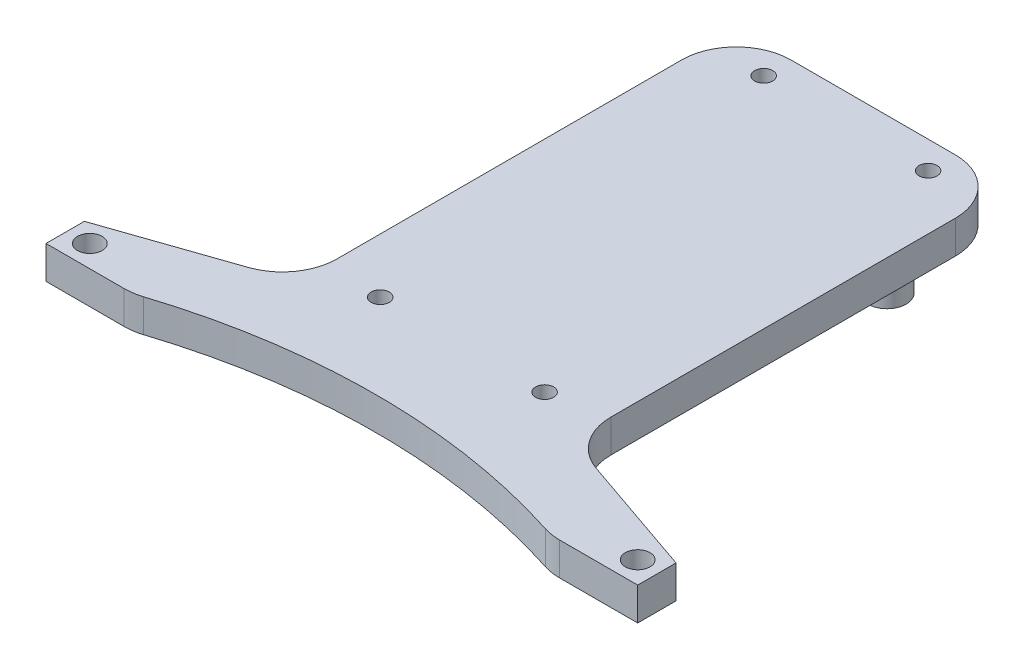
ISO-10303-21;
HEADER;
FILE_DESCRIPTION(('STEP AP214'),'2;1');
FILE_NAME('part.step','',(''),(''),'','','');
FILE_SCHEMA(('AUTOMOTIVE_DESIGN { 1 0 10303 214 1 1 1 1 }'));
ENDSEC;
DATA;
#1=APPLICATION_CONTEXT('core data for automotive mechanical design processes');
#2=APPLICATION_PROTOCOL_DEFINITION('international standard','automotive_design',2000,#1);
#3=PRODUCT_CONTEXT('',#1,'mechanical');
#4=PRODUCT('Part','Part','',(#3));
#5=PRODUCT_RELATED_PRODUCT_CATEGORY('part','',(#4));
#6=PRODUCT_DEFINITION_FORMATION('','',#4);
#7=PRODUCT_DEFINITION_CONTEXT('part definition',#1,'design');
#8=PRODUCT_DEFINITION('design','',#6,#7);
#9=PRODUCT_DEFINITION_SHAPE('','',#8);
#10=(LENGTH_UNIT() NAMED_UNIT(*) SI_UNIT(.MILLI.,.METRE.));
#11=(NAMED_UNIT(*) PLANE_ANGLE_UNIT() SI_UNIT($,.RADIAN.));
#12=(NAMED_UNIT(*) SI_UNIT($,.STERADIAN.) SOLID_ANGLE_UNIT());
#13=UNCERTAINTY_MEASURE_WITH_UNIT(LENGTH_MEASURE(1.E-05),#10,'distance_accuracy_value','');
#14=(GEOMETRIC_REPRESENTATION_CONTEXT(3) GLOBAL_UNCERTAINTY_ASSIGNED_CONTEXT((#13)) GLOBAL_UNIT_ASSIGNED_CONTEXT((#10,
#11,#12)) REPRESENTATION_CONTEXT('',''));
#15=CARTESIAN_POINT('',(0.,0.,0.));
#16=DIRECTION('',(0.,0.,1.));
#17=DIRECTION('',(1.,0.,0.));
#18=AXIS2_PLACEMENT_3D('',#15,#16,#17);
#19=CARTESIAN_POINT('',(0.,6.,0.));
#20=DIRECTION('',(0.,-1.,0.));
#21=DIRECTION('',(0.,0.,-1.));
#22=AXIS2_PLACEMENT_3D('',#19,#20,#21);
#23=PLANE('',#22);
#24=CARTESIAN_POINT('',(54.,6.,114.78240283249));
#25=DIRECTION('',(0.,1.,0.));
#26=DIRECTION('',(0.,0.,1.));
#27=AXIS2_PLACEMENT_3D('',#24,#25,#26);
#28=CIRCLE('',#27,120.);
#29=CARTESIAN_POINT('',(90.6673848479396,6.,0.521723294806958));
#30=VERTEX_POINT('',#29);
#31=CARTESIAN_POINT('',(17.3326151520604,6.,0.521723294806958));
#32=VERTEX_POINT('',#31);
#33=EDGE_CURVE('E212',#30,#32,#28,.T.);
#34=ORIENTED_EDGE('',*,*,#33,.F.);
#35=CARTESIAN_POINT('',(93.7230002519345,6.,-8.99999999999997));
#36=DIRECTION('',(0.,-1.,0.));
#37=DIRECTION('',(0.,0.,-1.));
#38=AXIS2_PLACEMENT_3D('',#35,#36,#37);
#39=CIRCLE('',#38,10.);
#40=CARTESIAN_POINT('',(93.7230002519345,6.,1.));
#41=VERTEX_POINT('',#40);
#42=EDGE_CURVE('E345',#30,#41,#39,.F.);
#43=ORIENTED_EDGE('',*,*,#42,.T.);
#44=DIRECTION('',(1.,0.,0.));
#45=VECTOR('',#44,1.);
#46=CARTESIAN_POINT('',(108.,6.,1.));
#47=LINE('',#46,#45);
#48=CARTESIAN_POINT('',(108.,6.,1.));
#49=VERTEX_POINT('',#48);
#50=EDGE_CURVE('E168',#41,#49,#47,.T.);
#51=ORIENTED_EDGE('',*,*,#50,.T.);
#52=DIRECTION('',(0.,0.,-1.));
#53=VECTOR('',#52,1.);
#54=CARTESIAN_POINT('',(108.,6.,0.));
#55=LINE('',#54,#53);
#56=CARTESIAN_POINT('',(108.,6.,-6.));
#57=VERTEX_POINT('',#56);
#58=EDGE_CURVE('E182',#49,#57,#55,.T.);
#59=ORIENTED_EDGE('',*,*,#58,.T.);
#60=DIRECTION('',(-0.945372981626272,0.,-0.325990683319405));
#61=VECTOR('',#60,1.);
#62=CARTESIAN_POINT('',(79.,6.,-16.));
#63=LINE('',#62,#61);
#64=CARTESIAN_POINT('',(85.7400931668059,6.,-13.6758299424807));
#65=VERTEX_POINT('',#64);
#66=EDGE_CURVE('E267',#57,#65,#63,.T.);
#67=ORIENTED_EDGE('',*,*,#66,.T.);
#68=CARTESIAN_POINT('',(89.,6.,-23.1295597587434));
#69=DIRECTION('',(0.,-1.,0.));
#70=DIRECTION('',(0.,0.,-1.));
#71=AXIS2_PLACEMENT_3D('',#68,#69,#70);
#72=CIRCLE('',#71,10.);
#73=CARTESIAN_POINT('',(79.,6.,-23.1295597587434));
#74=VERTEX_POINT('',#73);
#75=EDGE_CURVE('E395',#65,#74,#72,.T.);
#76=ORIENTED_EDGE('',*,*,#75,.T.);
#77=DIRECTION('',(0.,0.,-1.));
#78=VECTOR('',#77,1.);
#79=CARTESIAN_POINT('',(79.,6.,-96.));
#80=LINE('',#79,#78);
#81=CARTESIAN_POINT('',(79.,6.,-86.));
#82=VERTEX_POINT('',#81);
#83=EDGE_CURVE('E271',#74,#82,#80,.T.);
#84=ORIENTED_EDGE('',*,*,#83,.T.);
#85=CARTESIAN_POINT('',(69.,6.,-86.));
#86=DIRECTION('',(0.,-1.,0.));
#87=DIRECTION('',(0.,0.,-1.));
#88=AXIS2_PLACEMENT_3D('',#85,#86,#87);
#89=CIRCLE('',#88,10.);
#90=CARTESIAN_POINT('',(69.,6.,-96.));
#91=VERTEX_POINT('',#90);
#92=EDGE_CURVE('E339',#82,#91,#89,.F.);
#93=ORIENTED_EDGE('',*,*,#92,.T.);
#94=DIRECTION('',(-1.,0.,0.));
#95=VECTOR('',#94,1.);
#96=CARTESIAN_POINT('',(29.,6.,-96.));
#97=LINE('',#96,#95);
#98=CARTESIAN_POINT('',(39.,6.,-96.));
#99=VERTEX_POINT('',#98);
#100=EDGE_CURVE('E275',#91,#99,#97,.T.);
#101=ORIENTED_EDGE('',*,*,#100,.T.);
#102=CARTESIAN_POINT('',(39.,6.,-86.));
#103=DIRECTION('',(0.,-1.,0.));
#104=DIRECTION('',(0.,0.,-1.));
#105=AXIS2_PLACEMENT_3D('',#102,#103,#104);
#106=CIRCLE('',#105,10.);
#107=CARTESIAN_POINT('',(29.,6.,-86.));
#108=VERTEX_POINT('',#107);
#109=EDGE_CURVE('E336',#99,#108,#106,.F.);
#110=ORIENTED_EDGE('',*,*,#109,.T.);
#111=DIRECTION('',(0.,0.,1.));
#112=VECTOR('',#111,1.);
#113=CARTESIAN_POINT('',(29.,6.,-16.));
#114=LINE('',#113,#112);
#115=CARTESIAN_POINT('',(29.,6.,-23.1295597587434));
#116=VERTEX_POINT('',#115);
#117=EDGE_CURVE('E279',#108,#116,#114,.T.);
#118=ORIENTED_EDGE('',*,*,#117,.T.);
#119=CARTESIAN_POINT('',(19.,6.,-23.1295597587434));
#120=DIRECTION('',(0.,-1.,0.));
#121=DIRECTION('',(0.,0.,-1.));
#122=AXIS2_PLACEMENT_3D('',#119,#120,#121);
#123=CIRCLE('',#122,10.);
#124=CARTESIAN_POINT('',(22.259906833194,6.,-13.6758299424807));
#125=VERTEX_POINT('',#124);
#126=EDGE_CURVE('E11',#116,#125,#123,.T.);
#127=ORIENTED_EDGE('',*,*,#126,.T.);
#128=DIRECTION('',(-0.945372981626272,0.,0.325990683319404));
#129=VECTOR('',#128,1.);
#130=CARTESIAN_POINT('',(0.,6.,-6.));
#131=LINE('',#130,#129);
#132=CARTESIAN_POINT('',(0.,6.,-6.));
#133=VERTEX_POINT('',#132);
#134=EDGE_CURVE('E283',#125,#133,#131,.T.);
#135=ORIENTED_EDGE('',*,*,#134,.T.);
#136=DIRECTION('',(0.,0.,1.));
#137=VECTOR('',#136,1.);
#138=CARTESIAN_POINT('',(0.,6.,0.));
#139=LINE('',#138,#137);
#140=CARTESIAN_POINT('',(0.,6.,1.));
#141=VERTEX_POINT('',#140);
#142=EDGE_CURVE('E261',#133,#141,#139,.T.);
#143=ORIENTED_EDGE('',*,*,#142,.T.);
#144=DIRECTION('',(1.,0.,0.));
#145=VECTOR('',#144,1.);
#146=CARTESIAN_POINT('',(0.,6.,1.));
#147=LINE('',#146,#145);
#148=CARTESIAN_POINT('',(14.2769997480654,6.,1.));
#149=VERTEX_POINT('',#148);
#150=EDGE_CURVE('E188',#141,#149,#147,.T.);
#151=ORIENTED_EDGE('',*,*,#150,.T.);
#152=CARTESIAN_POINT('',(14.2769997480654,6.,-8.99999999999997));
#153=DIRECTION('',(0.,-1.,0.));
#154=DIRECTION('',(0.,0.,-1.));
#155=AXIS2_PLACEMENT_3D('',#152,#153,#154);
#156=CIRCLE('',#155,10.);
#157=EDGE_CURVE('E342',#149,#32,#156,.F.);
#158=ORIENTED_EDGE('',*,*,#157,.T.);
#159=EDGE_LOOP('',(#34,#43,#51,#59,#67,#76,#84,#93,#101,#110,#118,#127,#135,#143,#151,#158));
#160=FACE_BOUND('',#159,.T.);
#161=CARTESIAN_POINT('',(4.,6.,-3.));
#162=DIRECTION('',(0.,1.,0.));
#163=DIRECTION('',(0.,0.,1.));
#164=AXIS2_PLACEMENT_3D('',#161,#162,#163);
#165=CIRCLE('',#164,2.25);
#166=CARTESIAN_POINT('',(4.,6.,-0.749999999999999));
#167=VERTEX_POINT('',#166);
#168=EDGE_CURVE('E254',#167,#167,#165,.T.);
#169=ORIENTED_EDGE('',*,*,#168,.F.);
#170=EDGE_LOOP('',(#169));
#171=FACE_BOUND('',#170,.T.);
#172=CARTESIAN_POINT('',(104.,6.,-3.));
#173=DIRECTION('',(0.,1.,0.));
#174=DIRECTION('',(0.,0.,1.));
#175=AXIS2_PLACEMENT_3D('',#172,#173,#174);
#176=CIRCLE('',#175,2.25);
#177=CARTESIAN_POINT('',(104.,6.,-0.750000000000004));
#178=VERTEX_POINT('',#177);
#179=EDGE_CURVE('E246',#178,#178,#176,.T.);
#180=ORIENTED_EDGE('',*,*,#179,.F.);
#181=EDGE_LOOP('',(#180));
#182=FACE_BOUND('',#181,.T.);
#183=CARTESIAN_POINT('',(39.,6.,-91.));
#184=DIRECTION('',(0.,1.,0.));
#185=DIRECTION('',(0.,0.,1.));
#186=AXIS2_PLACEMENT_3D('',#183,#184,#185);
#187=CIRCLE('',#186,1.65);
#188=CARTESIAN_POINT('',(39.,6.,-89.35));
#189=VERTEX_POINT('',#188);
#190=EDGE_CURVE('E238',#189,#189,#187,.T.);
#191=ORIENTED_EDGE('',*,*,#190,.F.);
#192=EDGE_LOOP('',(#191));
#193=FACE_BOUND('',#192,.T.);
#194=CARTESIAN_POINT('',(69.,6.,-91.));
#195=DIRECTION('',(0.,1.,0.));
#196=DIRECTION('',(0.,0.,1.));
#197=AXIS2_PLACEMENT_3D('',#194,#195,#196);
#198=CIRCLE('',#197,1.65);
#199=CARTESIAN_POINT('',(69.,6.,-89.35));
#200=VERTEX_POINT('',#199);
#201=EDGE_CURVE('E230',#200,#200,#198,.T.);
#202=ORIENTED_EDGE('',*,*,#201,.F.);
#203=EDGE_LOOP('',(#202));
#204=FACE_BOUND('',#203,.T.);
#205=CARTESIAN_POINT('',(39.,6.,-21.));
#206=DIRECTION('',(0.,1.,0.));
#207=DIRECTION('',(0.,0.,1.));
#208=AXIS2_PLACEMENT_3D('',#205,#206,#207);
#209=CIRCLE('',#208,1.65);
#210=CARTESIAN_POINT('',(39.,6.,-19.35));
#211=VERTEX_POINT('',#210);
#212=EDGE_CURVE('E222',#211,#211,#209,.T.);
#213=ORIENTED_EDGE('',*,*,#212,.F.);
#214=EDGE_LOOP('',(#213));
#215=FACE_BOUND('',#214,.T.);
#216=CARTESIAN_POINT('',(68.9999999999999,6.,-21.));
#217=DIRECTION('',(0.,1.,0.));
#218=DIRECTION('',(0.,0.,1.));
#219=AXIS2_PLACEMENT_3D('',#216,#217,#218);
#220=CIRCLE('',#219,1.65);
#221=CARTESIAN_POINT('',(68.9999999999999,6.,-19.35));
#222=VERTEX_POINT('',#221);
#223=EDGE_CURVE('E213',#222,#222,#220,.T.);
#224=ORIENTED_EDGE('',*,*,#223,.F.);
#225=EDGE_LOOP('',(#224));
#226=FACE_BOUND('',#225,.T.);
#227=ADVANCED_FACE('F45',(#160,#171,#182,#193,#204,#215,#226),#23,.F.);
#228=CARTESIAN_POINT('',(0.,0.,0.));
#229=DIRECTION('',(0.,-1.,0.));
#230=DIRECTION('',(0.,0.,-1.));
#231=AXIS2_PLACEMENT_3D('',#228,#229,#230);
#232=PLANE('',#231);
#233=CARTESIAN_POINT('',(71.5,0.,-81.));
#234=DIRECTION('',(0.,-1.,0.));
#235=DIRECTION('',(0.,0.,-1.));
#236=AXIS2_PLACEMENT_3D('',#233,#234,#235);
#237=CIRCLE('',#236,5.50000000000001);
#238=CARTESIAN_POINT('',(71.5,0.,-86.5));
#239=VERTEX_POINT('',#238);
#240=EDGE_CURVE('E321',#239,#239,#237,.F.);
#241=ORIENTED_EDGE('',*,*,#240,.T.);
#242=EDGE_LOOP('',(#241));
#243=FACE_BOUND('',#242,.T.);
#244=CARTESIAN_POINT('',(36.5,0.,-81.));
#245=DIRECTION('',(0.,-1.,0.));
#246=DIRECTION('',(0.,0.,-1.));
#247=AXIS2_PLACEMENT_3D('',#244,#245,#246);
#248=CIRCLE('',#247,5.50000000000001);
#249=CARTESIAN_POINT('',(36.5,0.,-86.5));
#250=VERTEX_POINT('',#249);
#251=EDGE_CURVE('E317',#250,#250,#248,.F.);
#252=ORIENTED_EDGE('',*,*,#251,.T.);
#253=EDGE_LOOP('',(#252));
#254=FACE_BOUND('',#253,.T.);
#255=DIRECTION('',(1.,0.,0.));
#256=VECTOR('',#255,1.);
#257=CARTESIAN_POINT('',(108.,0.,1.));
#258=LINE('',#257,#256);
#259=CARTESIAN_POINT('',(93.7230002519345,0.,1.));
#260=VERTEX_POINT('',#259);
#261=CARTESIAN_POINT('',(108.,0.,1.));
#262=VERTEX_POINT('',#261);
#263=EDGE_CURVE('E158',#260,#262,#258,.T.);
#264=ORIENTED_EDGE('',*,*,#263,.F.);
#265=CARTESIAN_POINT('',(93.7230002519345,0.,-8.99999999999997));
#266=DIRECTION('',(0.,-1.,0.));
#267=DIRECTION('',(0.,0.,-1.));
#268=AXIS2_PLACEMENT_3D('',#265,#266,#267);
#269=CIRCLE('',#268,10.);
#270=CARTESIAN_POINT('',(90.6673848479396,0.,0.521723294806958));
#271=VERTEX_POINT('',#270);
#272=EDGE_CURVE('E358',#260,#271,#269,.T.);
#273=ORIENTED_EDGE('',*,*,#272,.T.);
#274=CARTESIAN_POINT('',(54.,0.,114.78240283249));
#275=DIRECTION('',(0.,1.,0.));
#276=DIRECTION('',(0.,0.,-1.));
#277=AXIS2_PLACEMENT_3D('',#274,#275,#276);
#278=CIRCLE('',#277,120.);
#279=CARTESIAN_POINT('',(17.3326151520604,0.,0.521723294806958));
#280=VERTEX_POINT('',#279);
#281=EDGE_CURVE('E208',#271,#280,#278,.T.);
#282=ORIENTED_EDGE('',*,*,#281,.T.);
#283=CARTESIAN_POINT('',(14.2769997480654,0.,-8.99999999999997));
#284=DIRECTION('',(0.,-1.,0.));
#285=DIRECTION('',(0.,0.,-1.));
#286=AXIS2_PLACEMENT_3D('',#283,#284,#285);
#287=CIRCLE('',#286,10.);
#288=CARTESIAN_POINT('',(14.2769997480654,0.,1.));
#289=VERTEX_POINT('',#288);
#290=EDGE_CURVE('E355',#280,#289,#287,.T.);
#291=ORIENTED_EDGE('',*,*,#290,.T.);
#292=DIRECTION('',(1.,0.,0.));
#293=VECTOR('',#292,1.);
#294=CARTESIAN_POINT('',(0.,0.,1.));
#295=LINE('',#294,#293);
#296=CARTESIAN_POINT('',(0.,0.,1.));
#297=VERTEX_POINT('',#296);
#298=EDGE_CURVE('E193',#297,#289,#295,.T.);
#299=ORIENTED_EDGE('',*,*,#298,.F.);
#300=DIRECTION('',(0.,0.,1.));
#301=VECTOR('',#300,1.);
#302=CARTESIAN_POINT('',(0.,0.,0.));
#303=LINE('',#302,#301);
#304=CARTESIAN_POINT('',(0.,0.,-6.));
#305=VERTEX_POINT('',#304);
#306=EDGE_CURVE('E178',#305,#297,#303,.T.);
#307=ORIENTED_EDGE('',*,*,#306,.F.);
#308=DIRECTION('',(-0.945372981626272,0.,0.325990683319404));
#309=VECTOR('',#308,1.);
#310=CARTESIAN_POINT('',(0.,0.,-6.));
#311=LINE('',#310,#309);
#312=CARTESIAN_POINT('',(22.259906833194,0.,-13.6758299424807));
#313=VERTEX_POINT('',#312);
#314=EDGE_CURVE('E264',#313,#305,#311,.T.);
#315=ORIENTED_EDGE('',*,*,#314,.F.);
#316=CARTESIAN_POINT('',(19.,0.,-23.1295597587434));
#317=DIRECTION('',(0.,-1.,0.));
#318=DIRECTION('',(0.,0.,-1.));
#319=AXIS2_PLACEMENT_3D('',#316,#317,#318);
#320=CIRCLE('',#319,10.);
#321=CARTESIAN_POINT('',(29.,0.,-23.1295597587434));
#322=VERTEX_POINT('',#321);
#323=EDGE_CURVE('E54',#313,#322,#320,.F.);
#324=ORIENTED_EDGE('',*,*,#323,.T.);
#325=DIRECTION('',(0.,0.,1.));
#326=VECTOR('',#325,1.);
#327=CARTESIAN_POINT('',(29.,0.,-16.));
#328=LINE('',#327,#326);
#329=CARTESIAN_POINT('',(29.,0.,-86.));
#330=VERTEX_POINT('',#329);
#331=EDGE_CURVE('E298',#330,#322,#328,.T.);
#332=ORIENTED_EDGE('',*,*,#331,.F.);
#333=CARTESIAN_POINT('',(39.,0.,-86.));
#334=DIRECTION('',(0.,-1.,0.));
#335=DIRECTION('',(0.,0.,-1.));
#336=AXIS2_PLACEMENT_3D('',#333,#334,#335);
#337=CIRCLE('',#336,10.);
#338=CARTESIAN_POINT('',(39.,0.,-96.));
#339=VERTEX_POINT('',#338);
#340=EDGE_CURVE('E350',#330,#339,#337,.T.);
#341=ORIENTED_EDGE('',*,*,#340,.T.);
#342=DIRECTION('',(-1.,0.,0.));
#343=VECTOR('',#342,1.);
#344=CARTESIAN_POINT('',(29.,0.,-96.));
#345=LINE('',#344,#343);
#346=CARTESIAN_POINT('',(69.,0.,-96.));
#347=VERTEX_POINT('',#346);
#348=EDGE_CURVE('E294',#347,#339,#345,.T.);
#349=ORIENTED_EDGE('',*,*,#348,.F.);
#350=CARTESIAN_POINT('',(69.,0.,-86.));
#351=DIRECTION('',(0.,-1.,0.));
#352=DIRECTION('',(0.,0.,-1.));
#353=AXIS2_PLACEMENT_3D('',#350,#351,#352);
#354=CIRCLE('',#353,10.);
#355=CARTESIAN_POINT('',(79.,0.,-86.));
#356=VERTEX_POINT('',#355);
#357=EDGE_CURVE('E67',#347,#356,#354,.T.);
#358=ORIENTED_EDGE('',*,*,#357,.T.);
#359=DIRECTION('',(0.,0.,-1.));
#360=VECTOR('',#359,1.);
#361=CARTESIAN_POINT('',(79.,0.,-96.));
#362=LINE('',#361,#360);
#363=CARTESIAN_POINT('',(79.,0.,-23.1295597587434));
#364=VERTEX_POINT('',#363);
#365=EDGE_CURVE('E291',#364,#356,#362,.T.);
#366=ORIENTED_EDGE('',*,*,#365,.F.);
#367=CARTESIAN_POINT('',(89.,0.,-23.1295597587434));
#368=DIRECTION('',(0.,-1.,0.));
#369=DIRECTION('',(0.,0.,-1.));
#370=AXIS2_PLACEMENT_3D('',#367,#368,#369);
#371=CIRCLE('',#370,10.);
#372=CARTESIAN_POINT('',(85.7400931668059,0.,-13.6758299424807));
#373=VERTEX_POINT('',#372);
#374=EDGE_CURVE('E61',#364,#373,#371,.F.);
#375=ORIENTED_EDGE('',*,*,#374,.T.);
#376=DIRECTION('',(-0.945372981626272,0.,-0.325990683319405));
#377=VECTOR('',#376,1.);
#378=CARTESIAN_POINT('',(79.,0.,-16.));
#379=LINE('',#378,#377);
#380=CARTESIAN_POINT('',(108.,0.,-6.));
#381=VERTEX_POINT('',#380);
#382=EDGE_CURVE('E173',#381,#373,#379,.T.);
#383=ORIENTED_EDGE('',*,*,#382,.F.);
#384=DIRECTION('',(0.,0.,-1.));
#385=VECTOR('',#384,1.);
#386=CARTESIAN_POINT('',(108.,0.,0.));
#387=LINE('',#386,#385);
#388=EDGE_CURVE('E170',#262,#381,#387,.T.);
#389=ORIENTED_EDGE('',*,*,#388,.F.);
#390=EDGE_LOOP('',(#264,#273,#282,#291,#299,#307,#315,#324,#332,#341,#349,#358,#366,#375,#383,#389));
#391=FACE_BOUND('',#390,.T.);
#392=CARTESIAN_POINT('',(39.,0.,-21.));
#393=DIRECTION('',(0.,1.,0.));
#394=DIRECTION('',(0.,0.,1.));
#395=AXIS2_PLACEMENT_3D('',#392,#393,#394);
#396=CIRCLE('',#395,1.65);
#397=CARTESIAN_POINT('',(39.,0.,-19.35));
#398=VERTEX_POINT('',#397);
#399=EDGE_CURVE('E217',#398,#398,#396,.T.);
#400=ORIENTED_EDGE('',*,*,#399,.T.);
#401=EDGE_LOOP('',(#400));
#402=FACE_BOUND('',#401,.T.);
#403=CARTESIAN_POINT('',(39.,0.,-91.));
#404=DIRECTION('',(0.,1.,0.));
#405=DIRECTION('',(0.,0.,1.));
#406=AXIS2_PLACEMENT_3D('',#403,#404,#405);
#407=CIRCLE('',#406,1.65);
#408=CARTESIAN_POINT('',(39.,0.,-89.35));
#409=VERTEX_POINT('',#408);
#410=EDGE_CURVE('E234',#409,#409,#407,.T.);
#411=ORIENTED_EDGE('',*,*,#410,.T.);
#412=EDGE_LOOP('',(#411));
#413=FACE_BOUND('',#412,.T.);
#414=CARTESIAN_POINT('',(4.,0.,-3.));
#415=DIRECTION('',(0.,1.,0.));
#416=DIRECTION('',(0.,0.,1.));
#417=AXIS2_PLACEMENT_3D('',#414,#415,#416);
#418=CIRCLE('',#417,2.25);
#419=CARTESIAN_POINT('',(4.,0.,-0.749999999999999));
#420=VERTEX_POINT('',#419);
#421=EDGE_CURVE('E250',#420,#420,#418,.T.);
#422=ORIENTED_EDGE('',*,*,#421,.T.);
#423=EDGE_LOOP('',(#422));
#424=FACE_BOUND('',#423,.T.);
#425=CARTESIAN_POINT('',(104.,0.,-3.));
#426=DIRECTION('',(0.,1.,0.));
#427=DIRECTION('',(0.,0.,1.));
#428=AXIS2_PLACEMENT_3D('',#425,#426,#427);
#429=CIRCLE('',#428,2.25);
#430=CARTESIAN_POINT('',(104.,0.,-0.750000000000004));
#431=VERTEX_POINT('',#430);
#432=EDGE_CURVE('E242',#431,#431,#429,.T.);
#433=ORIENTED_EDGE('',*,*,#432,.T.);
#434=EDGE_LOOP('',(#433));
#435=FACE_BOUND('',#434,.T.);
#436=CARTESIAN_POINT('',(69.,0.,-91.));
#437=DIRECTION('',(0.,1.,0.));
#438=DIRECTION('',(0.,0.,1.));
#439=AXIS2_PLACEMENT_3D('',#436,#437,#438);
#440=CIRCLE('',#439,1.65);
#441=CARTESIAN_POINT('',(69.,0.,-89.35));
#442=VERTEX_POINT('',#441);
#443=EDGE_CURVE('E226',#442,#442,#440,.T.);
#444=ORIENTED_EDGE('',*,*,#443,.T.);
#445=EDGE_LOOP('',(#444));
#446=FACE_BOUND('',#445,.T.);
#447=CARTESIAN_POINT('',(68.9999999999999,0.,-21.));
#448=DIRECTION('',(0.,1.,0.));
#449=DIRECTION('',(0.,0.,1.));
#450=AXIS2_PLACEMENT_3D('',#447,#448,#449);
#451=CIRCLE('',#450,1.65);
#452=CARTESIAN_POINT('',(68.9999999999999,0.,-19.35));
#453=VERTEX_POINT('',#452);
#454=EDGE_CURVE('E218',#453,#453,#451,.T.);
#455=ORIENTED_EDGE('',*,*,#454,.T.);
#456=EDGE_LOOP('',(#455));
#457=FACE_BOUND('',#456,.T.);
#458=ADVANCED_FACE('F171',(#243,#254,#391,#402,#413,#424,#435,#446,#457),#232,.T.);
#459=CARTESIAN_POINT('',(0.,6.,0.));
#460=DIRECTION('',(1.,0.,0.));
#461=DIRECTION('',(0.,0.,-1.));
#462=AXIS2_PLACEMENT_3D('',#459,#460,#461);
#463=PLANE('',#462);
#464=ORIENTED_EDGE('',*,*,#306,.T.);
#465=DIRECTION('',(0.,1.,0.));
#466=VECTOR('',#465,1.);
#467=CARTESIAN_POINT('',(0.,-19.0262975904404,1.));
#468=LINE('',#467,#466);
#469=EDGE_CURVE('E192',#297,#141,#468,.T.);
#470=ORIENTED_EDGE('',*,*,#469,.T.);
#471=ORIENTED_EDGE('',*,*,#142,.F.);
#472=DIRECTION('',(0.,-1.,0.));
#473=VECTOR('',#472,1.);
#474=CARTESIAN_POINT('',(0.,6.,-6.));
#475=LINE('',#474,#473);
#476=EDGE_CURVE('E286',#133,#305,#475,.T.);
#477=ORIENTED_EDGE('',*,*,#476,.T.);
#478=EDGE_LOOP('',(#464,#470,#471,#477));
#479=FACE_BOUND('',#478,.T.);
#480=ADVANCED_FACE('F418',(#479),#463,.F.);
#481=CARTESIAN_POINT('',(108.,6.,0.));
#482=DIRECTION('',(-1.,0.,0.));
#483=DIRECTION('',(0.,0.,1.));
#484=AXIS2_PLACEMENT_3D('',#481,#482,#483);
#485=PLANE('',#484);
#486=ORIENTED_EDGE('',*,*,#388,.T.);
#487=DIRECTION('',(0.,-1.,0.));
#488=VECTOR('',#487,1.);
#489=CARTESIAN_POINT('',(108.,6.,-6.));
#490=LINE('',#489,#488);
#491=EDGE_CURVE('E307',#57,#381,#490,.T.);
#492=ORIENTED_EDGE('',*,*,#491,.F.);
#493=ORIENTED_EDGE('',*,*,#58,.F.);
#494=DIRECTION('',(0.,1.,0.));
#495=VECTOR('',#494,1.);
#496=CARTESIAN_POINT('',(108.,-19.0262975904404,1.));
#497=LINE('',#496,#495);
#498=EDGE_CURVE('E163',#262,#49,#497,.T.);
#499=ORIENTED_EDGE('',*,*,#498,.F.);
#500=EDGE_LOOP('',(#486,#492,#493,#499));
#501=FACE_BOUND('',#500,.T.);
#502=ADVANCED_FACE('F181',(#501),#485,.F.);
#503=CARTESIAN_POINT('',(79.,6.,-16.));
#504=DIRECTION('',(-0.325990683319405,0.,0.945372981626272));
#505=DIRECTION('',(0.945372981626272,0.,0.325990683319405));
#506=AXIS2_PLACEMENT_3D('',#503,#504,#505);
#507=PLANE('',#506);
#508=ORIENTED_EDGE('',*,*,#382,.T.);
#509=DIRECTION('',(0.,-1.,0.));
#510=VECTOR('',#509,1.);
#511=CARTESIAN_POINT('',(85.7400931668059,6.,-13.6758299424807));
#512=LINE('',#511,#510);
#513=EDGE_CURVE('E386',#373,#65,#512,.F.);
#514=ORIENTED_EDGE('',*,*,#513,.T.);
#515=ORIENTED_EDGE('',*,*,#66,.F.);
#516=ORIENTED_EDGE('',*,*,#491,.T.);
#517=EDGE_LOOP('',(#508,#514,#515,#516));
#518=FACE_BOUND('',#517,.T.);
#519=ADVANCED_FACE('F438',(#518),#507,.F.);
#520=CARTESIAN_POINT('',(79.,6.,-96.));
#521=DIRECTION('',(-1.,0.,0.));
#522=DIRECTION('',(0.,0.,1.));
#523=AXIS2_PLACEMENT_3D('',#520,#521,#522);
#524=PLANE('',#523);
#525=ORIENTED_EDGE('',*,*,#365,.T.);
#526=DIRECTION('',(0.,-1.,0.));
#527=VECTOR('',#526,1.);
#528=CARTESIAN_POINT('',(79.,6.,-86.));
#529=LINE('',#528,#527);
#530=EDGE_CURVE('E376',#356,#82,#529,.F.);
#531=ORIENTED_EDGE('',*,*,#530,.T.);
#532=ORIENTED_EDGE('',*,*,#83,.F.);
#533=DIRECTION('',(0.,-1.,0.));
#534=VECTOR('',#533,1.);
#535=CARTESIAN_POINT('',(79.,0.,-23.1295597587434));
#536=LINE('',#535,#534);
#537=EDGE_CURVE('E372',#74,#364,#536,.T.);
#538=ORIENTED_EDGE('',*,*,#537,.T.);
#539=EDGE_LOOP('',(#525,#531,#532,#538));
#540=FACE_BOUND('',#539,.T.);
#541=ADVANCED_FACE('F446',(#540),#524,.F.);
#542=CARTESIAN_POINT('',(29.,6.,-96.));
#543=DIRECTION('',(0.,0.,1.));
#544=DIRECTION('',(1.,0.,0.));
#545=AXIS2_PLACEMENT_3D('',#542,#543,#544);
#546=PLANE('',#545);
#547=ORIENTED_EDGE('',*,*,#100,.F.);
#548=DIRECTION('',(0.,-1.,0.));
#549=VECTOR('',#548,1.);
#550=CARTESIAN_POINT('',(69.,6.,-96.));
#551=LINE('',#550,#549);
#552=EDGE_CURVE('E368',#91,#347,#551,.T.);
#553=ORIENTED_EDGE('',*,*,#552,.T.);
#554=ORIENTED_EDGE('',*,*,#348,.T.);
#555=DIRECTION('',(0.,-1.,0.));
#556=VECTOR('',#555,1.);
#557=CARTESIAN_POINT('',(39.,6.,-96.));
#558=LINE('',#557,#556);
#559=EDGE_CURVE('E365',#339,#99,#558,.F.);
#560=ORIENTED_EDGE('',*,*,#559,.T.);
#561=EDGE_LOOP('',(#547,#553,#554,#560));
#562=FACE_BOUND('',#561,.T.);
#563=ADVANCED_FACE('F454',(#562),#546,.F.);
#564=CARTESIAN_POINT('',(29.,6.,-16.));
#565=DIRECTION('',(1.,0.,0.));
#566=DIRECTION('',(0.,0.,-1.));
#567=AXIS2_PLACEMENT_3D('',#564,#565,#566);
#568=PLANE('',#567);
#569=ORIENTED_EDGE('',*,*,#117,.F.);
#570=DIRECTION('',(0.,-1.,0.));
#571=VECTOR('',#570,1.);
#572=CARTESIAN_POINT('',(29.,6.,-86.));
#573=LINE('',#572,#571);
#574=EDGE_CURVE('E382',#108,#330,#573,.T.);
#575=ORIENTED_EDGE('',*,*,#574,.T.);
#576=ORIENTED_EDGE('',*,*,#331,.T.);
#577=DIRECTION('',(0.,-1.,0.));
#578=VECTOR('',#577,1.);
#579=CARTESIAN_POINT('',(29.,6.,-23.1295597587434));
#580=LINE('',#579,#578);
#581=EDGE_CURVE('E379',#322,#116,#580,.F.);
#582=ORIENTED_EDGE('',*,*,#581,.T.);
#583=EDGE_LOOP('',(#569,#575,#576,#582));
#584=FACE_BOUND('',#583,.T.);
#585=ADVANCED_FACE('F406',(#584),#568,.F.);
#586=CARTESIAN_POINT('',(0.,6.,-6.));
#587=DIRECTION('',(0.325990683319404,0.,0.945372981626272));
#588=DIRECTION('',(0.945372981626272,0.,-0.325990683319404));
#589=AXIS2_PLACEMENT_3D('',#586,#587,#588);
#590=PLANE('',#589);
#591=ORIENTED_EDGE('',*,*,#134,.F.);
#592=DIRECTION('',(0.,-1.,0.));
#593=VECTOR('',#592,1.);
#594=CARTESIAN_POINT('',(22.259906833194,0.,-13.6758299424807));
#595=LINE('',#594,#593);
#596=EDGE_CURVE('E389',#125,#313,#595,.T.);
#597=ORIENTED_EDGE('',*,*,#596,.T.);
#598=ORIENTED_EDGE('',*,*,#314,.T.);
#599=ORIENTED_EDGE('',*,*,#476,.F.);
#600=EDGE_LOOP('',(#591,#597,#598,#599));
#601=FACE_BOUND('',#600,.T.);
#602=ADVANCED_FACE('F415',(#601),#590,.F.);
#603=CARTESIAN_POINT('',(4.,6.,-3.));
#604=DIRECTION('',(0.,-1.,0.));
#605=DIRECTION('',(0.,0.,-1.));
#606=AXIS2_PLACEMENT_3D('',#603,#604,#605);
#607=CYLINDRICAL_SURFACE('',#606,2.25);
#608=ORIENTED_EDGE('',*,*,#168,.T.);
#609=EDGE_LOOP('',(#608));
#610=FACE_BOUND('',#609,.T.);
#611=ORIENTED_EDGE('',*,*,#421,.F.);
#612=EDGE_LOOP('',(#611));
#613=FACE_BOUND('',#612,.T.);
#614=ADVANCED_FACE('F473',(#610,#613),#607,.F.);
#615=CARTESIAN_POINT('',(104.,6.,-3.));
#616=DIRECTION('',(0.,-1.,0.));
#617=DIRECTION('',(0.,0.,-1.));
#618=AXIS2_PLACEMENT_3D('',#615,#616,#617);
#619=CYLINDRICAL_SURFACE('',#618,2.25);
#620=ORIENTED_EDGE('',*,*,#179,.T.);
#621=EDGE_LOOP('',(#620));
#622=FACE_BOUND('',#621,.T.);
#623=ORIENTED_EDGE('',*,*,#432,.F.);
#624=EDGE_LOOP('',(#623));
#625=FACE_BOUND('',#624,.T.);
#626=ADVANCED_FACE('F667',(#622,#625),#619,.F.);
#627=CARTESIAN_POINT('',(39.,6.,-91.));
#628=DIRECTION('',(0.,-1.,0.));
#629=DIRECTION('',(0.,0.,-1.));
#630=AXIS2_PLACEMENT_3D('',#627,#628,#629);
#631=CYLINDRICAL_SURFACE('',#630,1.65);
#632=ORIENTED_EDGE('',*,*,#190,.T.);
#633=EDGE_LOOP('',(#632));
#634=FACE_BOUND('',#633,.T.);
#635=ORIENTED_EDGE('',*,*,#410,.F.);
#636=EDGE_LOOP('',(#635));
#637=FACE_BOUND('',#636,.T.);
#638=ADVANCED_FACE('F657',(#634,#637),#631,.F.);
#639=CARTESIAN_POINT('',(69.,6.,-91.));
#640=DIRECTION('',(0.,-1.,0.));
#641=DIRECTION('',(0.,0.,-1.));
#642=AXIS2_PLACEMENT_3D('',#639,#640,#641);
#643=CYLINDRICAL_SURFACE('',#642,1.65);
#644=ORIENTED_EDGE('',*,*,#201,.T.);
#645=EDGE_LOOP('',(#644));
#646=FACE_BOUND('',#645,.T.);
#647=ORIENTED_EDGE('',*,*,#443,.F.);
#648=EDGE_LOOP('',(#647));
#649=FACE_BOUND('',#648,.T.);
#650=ADVANCED_FACE('F647',(#646,#649),#643,.F.);
#651=CARTESIAN_POINT('',(39.,6.,-21.));
#652=DIRECTION('',(0.,-1.,0.));
#653=DIRECTION('',(0.,0.,-1.));
#654=AXIS2_PLACEMENT_3D('',#651,#652,#653);
#655=CYLINDRICAL_SURFACE('',#654,1.65);
#656=ORIENTED_EDGE('',*,*,#212,.T.);
#657=EDGE_LOOP('',(#656));
#658=FACE_BOUND('',#657,.T.);
#659=ORIENTED_EDGE('',*,*,#399,.F.);
#660=EDGE_LOOP('',(#659));
#661=FACE_BOUND('',#660,.T.);
#662=ADVANCED_FACE('F637',(#658,#661),#655,.F.);
#663=CARTESIAN_POINT('',(68.9999999999999,6.,-21.));
#664=DIRECTION('',(0.,-1.,0.));
#665=DIRECTION('',(0.,0.,-1.));
#666=AXIS2_PLACEMENT_3D('',#663,#664,#665);
#667=CYLINDRICAL_SURFACE('',#666,1.65);
#668=ORIENTED_EDGE('',*,*,#223,.T.);
#669=EDGE_LOOP('',(#668));
#670=FACE_BOUND('',#669,.T.);
#671=ORIENTED_EDGE('',*,*,#454,.F.);
#672=EDGE_LOOP('',(#671));
#673=FACE_BOUND('',#672,.T.);
#674=ADVANCED_FACE('F628',(#670,#673),#667,.F.);
#675=CARTESIAN_POINT('',(54.,0.,114.78240283249));
#676=DIRECTION('',(0.,1.,0.));
#677=DIRECTION('',(0.,0.,1.));
#678=AXIS2_PLACEMENT_3D('',#675,#676,#677);
#679=CYLINDRICAL_SURFACE('',#678,120.);
#680=ORIENTED_EDGE('',*,*,#281,.F.);
#681=DIRECTION('',(0.,1.,0.));
#682=VECTOR('',#681,1.);
#683=CARTESIAN_POINT('',(90.6673848479396,0.,0.521723294806958));
#684=LINE('',#683,#682);
#685=EDGE_CURVE('E332',#271,#30,#684,.T.);
#686=ORIENTED_EDGE('',*,*,#685,.T.);
#687=ORIENTED_EDGE('',*,*,#33,.T.);
#688=DIRECTION('',(0.,1.,0.));
#689=VECTOR('',#688,1.);
#690=CARTESIAN_POINT('',(17.3326151520604,0.,0.521723294806958));
#691=LINE('',#690,#689);
#692=EDGE_CURVE('E329',#32,#280,#691,.F.);
#693=ORIENTED_EDGE('',*,*,#692,.T.);
#694=EDGE_LOOP('',(#680,#686,#687,#693));
#695=FACE_BOUND('',#694,.T.);
#696=ADVANCED_FACE('F431',(#695),#679,.F.);
#697=CARTESIAN_POINT('',(36.5,-7.1,-81.));
#698=DIRECTION('',(0.,1.,0.));
#699=DIRECTION('',(0.,0.,1.));
#700=AXIS2_PLACEMENT_3D('',#697,#698,#699);
#701=CYLINDRICAL_SURFACE('',#700,3.5);
#702=CARTESIAN_POINT('',(36.5,-2.00000000000002,-81.));
#703=DIRECTION('',(0.,-1.,0.));
#704=DIRECTION('',(0.,0.,-1.));
#705=AXIS2_PLACEMENT_3D('',#702,#703,#704);
#706=CIRCLE('',#705,3.5);
#707=CARTESIAN_POINT('',(36.5,-2.00000000000002,-84.5));
#708=VERTEX_POINT('',#707);
#709=EDGE_CURVE('E325',#708,#708,#706,.T.);
#710=ORIENTED_EDGE('',*,*,#709,.T.);
#711=EDGE_LOOP('',(#710));
#712=FACE_BOUND('',#711,.T.);
#713=CARTESIAN_POINT('',(36.5,-7.1,-81.));
#714=DIRECTION('',(0.,-1.,0.));
#715=DIRECTION('',(0.,0.,-1.));
#716=AXIS2_PLACEMENT_3D('',#713,#714,#715);
#717=CIRCLE('',#716,3.5);
#718=CARTESIAN_POINT('',(36.5,-7.1,-84.5));
#719=VERTEX_POINT('',#718);
#720=EDGE_CURVE('E204',#719,#719,#717,.T.);
#721=ORIENTED_EDGE('',*,*,#720,.F.);
#722=EDGE_LOOP('',(#721));
#723=FACE_BOUND('',#722,.T.);
#724=ADVANCED_FACE('F609',(#712,#723),#701,.T.);
#725=CARTESIAN_POINT('',(36.5,-7.1,-81.));
#726=DIRECTION('',(0.,-1.,0.));
#727=DIRECTION('',(0.,0.,-1.));
#728=AXIS2_PLACEMENT_3D('',#725,#726,#727);
#729=PLANE('',#728);
#730=ORIENTED_EDGE('',*,*,#720,.T.);
#731=EDGE_LOOP('',(#730));
#732=FACE_BOUND('',#731,.T.);
#733=ADVANCED_FACE('F599',(#732),#729,.T.);
#734=CARTESIAN_POINT('',(71.5,-7.1,-81.));
#735=DIRECTION('',(0.,1.,0.));
#736=DIRECTION('',(0.,0.,1.));
#737=AXIS2_PLACEMENT_3D('',#734,#735,#736);
#738=CYLINDRICAL_SURFACE('',#737,3.50000000000001);
#739=CARTESIAN_POINT('',(71.5,-2.00000000000002,-81.));
#740=DIRECTION('',(0.,-1.,0.));
#741=DIRECTION('',(0.,0.,-1.));
#742=AXIS2_PLACEMENT_3D('',#739,#740,#741);
#743=CIRCLE('',#742,3.50000000000001);
#744=CARTESIAN_POINT('',(71.5,-2.00000000000002,-84.5));
#745=VERTEX_POINT('',#744);
#746=EDGE_CURVE('E310',#745,#745,#743,.T.);
#747=ORIENTED_EDGE('',*,*,#746,.T.);
#748=EDGE_LOOP('',(#747));
#749=FACE_BOUND('',#748,.T.);
#750=CARTESIAN_POINT('',(71.5,-7.1,-81.));
#751=DIRECTION('',(0.,-1.,0.));
#752=DIRECTION('',(0.,0.,-1.));
#753=AXIS2_PLACEMENT_3D('',#750,#751,#752);
#754=CIRCLE('',#753,3.50000000000001);
#755=CARTESIAN_POINT('',(71.5,-7.1,-84.5));
#756=VERTEX_POINT('',#755);
#757=EDGE_CURVE('E197',#756,#756,#754,.T.);
#758=ORIENTED_EDGE('',*,*,#757,.F.);
#759=EDGE_LOOP('',(#758));
#760=FACE_BOUND('',#759,.T.);
#761=ADVANCED_FACE('F589',(#749,#760),#738,.T.);
#762=CARTESIAN_POINT('',(71.5,-7.1,-81.));
#763=DIRECTION('',(0.,-1.,0.));
#764=DIRECTION('',(0.,0.,-1.));
#765=AXIS2_PLACEMENT_3D('',#762,#763,#764);
#766=PLANE('',#765);
#767=ORIENTED_EDGE('',*,*,#757,.T.);
#768=EDGE_LOOP('',(#767));
#769=FACE_BOUND('',#768,.T.);
#770=ADVANCED_FACE('F498',(#769),#766,.T.);
#771=CARTESIAN_POINT('',(71.5,-2.00000000000002,-81.));
#772=DIRECTION('',(0.,1.,0.));
#773=DIRECTION('',(0.,0.,1.));
#774=AXIS2_PLACEMENT_3D('',#771,#772,#773);
#775=CONICAL_SURFACE('',#774,3.50000000000001,0.785398163397443);
#776=ORIENTED_EDGE('',*,*,#240,.F.);
#777=EDGE_LOOP('',(#776));
#778=FACE_BOUND('',#777,.T.);
#779=ORIENTED_EDGE('',*,*,#746,.F.);
#780=EDGE_LOOP('',(#779));
#781=FACE_BOUND('',#780,.T.);
#782=ADVANCED_FACE('F491',(#778,#781),#775,.T.);
#783=CARTESIAN_POINT('',(36.5,-2.00000000000002,-81.));
#784=DIRECTION('',(0.,1.,0.));
#785=DIRECTION('',(0.,0.,1.));
#786=AXIS2_PLACEMENT_3D('',#783,#784,#785);
#787=CONICAL_SURFACE('',#786,3.5,0.785398163397443);
#788=ORIENTED_EDGE('',*,*,#251,.F.);
#789=EDGE_LOOP('',(#788));
#790=FACE_BOUND('',#789,.T.);
#791=ORIENTED_EDGE('',*,*,#709,.F.);
#792=EDGE_LOOP('',(#791));
#793=FACE_BOUND('',#792,.T.);
#794=ADVANCED_FACE('F497',(#790,#793),#787,.T.);
#795=CARTESIAN_POINT('',(0.,-19.0262975904404,1.));
#796=DIRECTION('',(0.,0.,1.));
#797=DIRECTION('',(1.,0.,0.));
#798=AXIS2_PLACEMENT_3D('',#795,#796,#797);
#799=PLANE('',#798);
#800=ORIENTED_EDGE('',*,*,#298,.T.);
#801=DIRECTION('',(0.,-1.,0.));
#802=VECTOR('',#801,1.);
#803=CARTESIAN_POINT('',(14.2769997480654,6.,1.));
#804=LINE('',#803,#802);
#805=EDGE_CURVE('E361',#289,#149,#804,.F.);
#806=ORIENTED_EDGE('',*,*,#805,.T.);
#807=ORIENTED_EDGE('',*,*,#150,.F.);
#808=ORIENTED_EDGE('',*,*,#469,.F.);
#809=EDGE_LOOP('',(#800,#806,#807,#808));
#810=FACE_BOUND('',#809,.T.);
#811=ADVANCED_FACE('F422',(#810),#799,.T.);
#812=CARTESIAN_POINT('',(108.,-19.0262975904404,1.));
#813=DIRECTION('',(0.,0.,1.));
#814=DIRECTION('',(1.,0.,0.));
#815=AXIS2_PLACEMENT_3D('',#812,#813,#814);
#816=PLANE('',#815);
#817=ORIENTED_EDGE('',*,*,#50,.F.);
#818=DIRECTION('',(0.,-1.,0.));
#819=VECTOR('',#818,1.);
#820=CARTESIAN_POINT('',(93.7230002519345,0.,1.));
#821=LINE('',#820,#819);
#822=EDGE_CURVE('E165',#41,#260,#821,.T.);
#823=ORIENTED_EDGE('',*,*,#822,.T.);
#824=ORIENTED_EDGE('',*,*,#263,.T.);
#825=ORIENTED_EDGE('',*,*,#498,.T.);
#826=EDGE_LOOP('',(#817,#823,#824,#825));
#827=FACE_BOUND('',#826,.T.);
#828=ADVANCED_FACE('F161',(#827),#816,.T.);
#829=CARTESIAN_POINT('',(93.7230002519345,0.,-8.99999999999997));
#830=DIRECTION('',(0.,1.,0.));
#831=DIRECTION('',(0.,0.,1.));
#832=AXIS2_PLACEMENT_3D('',#829,#830,#831);
#833=CYLINDRICAL_SURFACE('',#832,10.);
#834=ORIENTED_EDGE('',*,*,#272,.F.);
#835=ORIENTED_EDGE('',*,*,#822,.F.);
#836=ORIENTED_EDGE('',*,*,#42,.F.);
#837=ORIENTED_EDGE('',*,*,#685,.F.);
#838=EDGE_LOOP('',(#834,#835,#836,#837));
#839=FACE_BOUND('',#838,.T.);
#840=ADVANCED_FACE('F434',(#839),#833,.T.);
#841=CARTESIAN_POINT('',(14.2769997480654,0.,-8.99999999999997));
#842=DIRECTION('',(0.,1.,0.));
#843=DIRECTION('',(0.,0.,1.));
#844=AXIS2_PLACEMENT_3D('',#841,#842,#843);
#845=CYLINDRICAL_SURFACE('',#844,10.);
#846=ORIENTED_EDGE('',*,*,#290,.F.);
#847=ORIENTED_EDGE('',*,*,#692,.F.);
#848=ORIENTED_EDGE('',*,*,#157,.F.);
#849=ORIENTED_EDGE('',*,*,#805,.F.);
#850=EDGE_LOOP('',(#846,#847,#848,#849));
#851=FACE_BOUND('',#850,.T.);
#852=ADVANCED_FACE('F427',(#851),#845,.T.);
#853=CARTESIAN_POINT('',(69.,6.,-86.));
#854=DIRECTION('',(0.,-1.,0.));
#855=DIRECTION('',(0.,0.,-1.));
#856=AXIS2_PLACEMENT_3D('',#853,#854,#855);
#857=CYLINDRICAL_SURFACE('',#856,10.);
#858=ORIENTED_EDGE('',*,*,#92,.F.);
#859=ORIENTED_EDGE('',*,*,#530,.F.);
#860=ORIENTED_EDGE('',*,*,#357,.F.);
#861=ORIENTED_EDGE('',*,*,#552,.F.);
#862=EDGE_LOOP('',(#858,#859,#860,#861));
#863=FACE_BOUND('',#862,.T.);
#864=ADVANCED_FACE('F449',(#863),#857,.T.);
#865=CARTESIAN_POINT('',(39.,6.,-86.));
#866=DIRECTION('',(0.,-1.,0.));
#867=DIRECTION('',(0.,0.,-1.));
#868=AXIS2_PLACEMENT_3D('',#865,#866,#867);
#869=CYLINDRICAL_SURFACE('',#868,10.);
#870=ORIENTED_EDGE('',*,*,#109,.F.);
#871=ORIENTED_EDGE('',*,*,#559,.F.);
#872=ORIENTED_EDGE('',*,*,#340,.F.);
#873=ORIENTED_EDGE('',*,*,#574,.F.);
#874=EDGE_LOOP('',(#870,#871,#872,#873));
#875=FACE_BOUND('',#874,.T.);
#876=ADVANCED_FACE('F457',(#875),#869,.T.);
#877=CARTESIAN_POINT('',(89.,6.,-23.1295597587434));
#878=DIRECTION('',(0.,1.,0.));
#879=DIRECTION('',(0.,0.,1.));
#880=AXIS2_PLACEMENT_3D('',#877,#878,#879);
#881=CYLINDRICAL_SURFACE('',#880,10.);
#882=ORIENTED_EDGE('',*,*,#75,.F.);
#883=ORIENTED_EDGE('',*,*,#513,.F.);
#884=ORIENTED_EDGE('',*,*,#374,.F.);
#885=ORIENTED_EDGE('',*,*,#537,.F.);
#886=EDGE_LOOP('',(#882,#883,#884,#885));
#887=FACE_BOUND('',#886,.T.);
#888=ADVANCED_FACE('F441',(#887),#881,.F.);
#889=CARTESIAN_POINT('',(19.,6.,-23.1295597587434));
#890=DIRECTION('',(0.,1.,0.));
#891=DIRECTION('',(0.,0.,1.));
#892=AXIS2_PLACEMENT_3D('',#889,#890,#891);
#893=CYLINDRICAL_SURFACE('',#892,10.);
#894=ORIENTED_EDGE('',*,*,#126,.F.);
#895=ORIENTED_EDGE('',*,*,#581,.F.);
#896=ORIENTED_EDGE('',*,*,#323,.F.);
#897=ORIENTED_EDGE('',*,*,#596,.F.);
#898=EDGE_LOOP('',(#894,#895,#896,#897));
#899=FACE_BOUND('',#898,.T.);
#900=ADVANCED_FACE('F47',(#899),#893,.F.);
#901=CLOSED_SHELL('',(#227,#458,#480,#502,#519,#541,#563,#585,#602,#614,#626,#638,#650,#662,
#674,#696,#724,#733,#761,#770,#782,#794,#811,#828,#840,#852,#864,#876,#888,#900));
#902=MANIFOLD_SOLID_BREP('B2',#901);
#903=ADVANCED_BREP_SHAPE_REPRESENTATION('',(#18,#902),#14);
#904=SHAPE_DEFINITION_REPRESENTATION(#9,#903);
ENDSEC;
END-ISO-10303-21;
